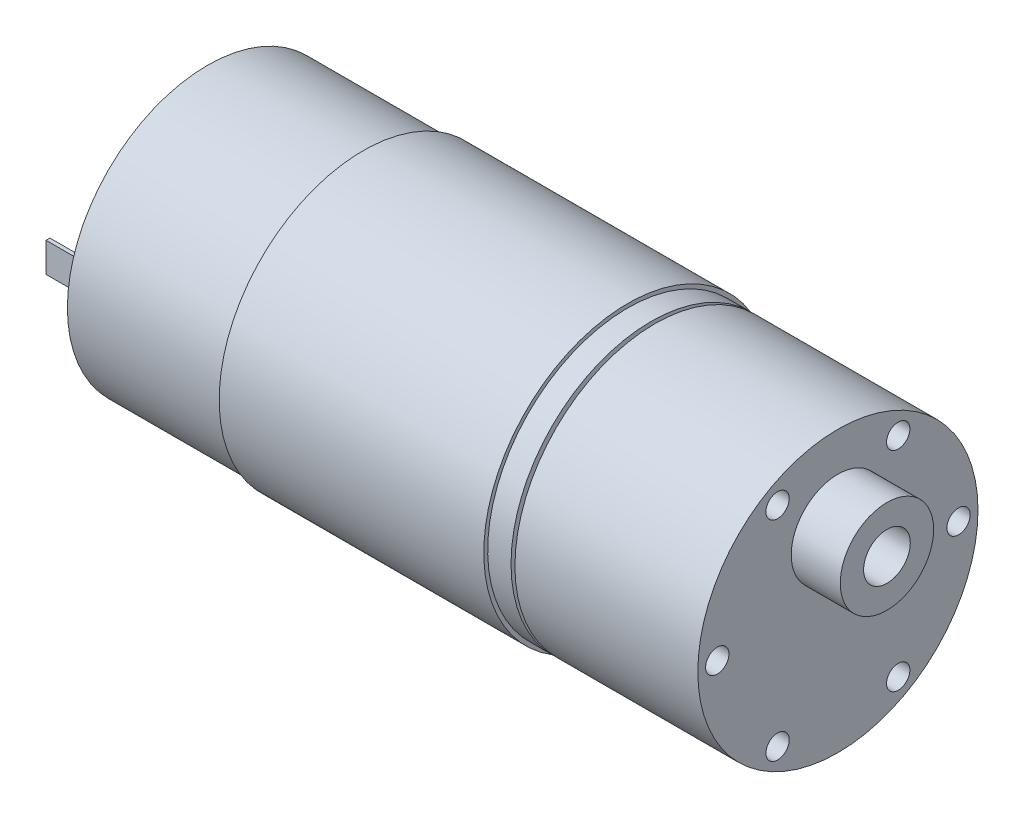
ISO-10303-21;
HEADER;
FILE_DESCRIPTION(('STEP AP214'),'2;1');
FILE_NAME('part.step','',(''),(''),'','','');
FILE_SCHEMA(('AUTOMOTIVE_DESIGN { 1 0 10303 214 1 1 1 1 }'));
ENDSEC;
DATA;
#1=APPLICATION_CONTEXT('core data for automotive mechanical design processes');
#2=APPLICATION_PROTOCOL_DEFINITION('international standard','automotive_design',2000,#1);
#3=PRODUCT_CONTEXT('',#1,'mechanical');
#4=PRODUCT('Part','Part','',(#3));
#5=PRODUCT_RELATED_PRODUCT_CATEGORY('part','',(#4));
#6=PRODUCT_DEFINITION_FORMATION('','',#4);
#7=PRODUCT_DEFINITION_CONTEXT('part definition',#1,'design');
#8=PRODUCT_DEFINITION('design','',#6,#7);
#9=PRODUCT_DEFINITION_SHAPE('','',#8);
#10=(LENGTH_UNIT() NAMED_UNIT(*) SI_UNIT(.MILLI.,.METRE.));
#11=(NAMED_UNIT(*) PLANE_ANGLE_UNIT() SI_UNIT($,.RADIAN.));
#12=(NAMED_UNIT(*) SI_UNIT($,.STERADIAN.) SOLID_ANGLE_UNIT());
#13=UNCERTAINTY_MEASURE_WITH_UNIT(LENGTH_MEASURE(1.E-05),#10,'distance_accuracy_value','');
#14=(GEOMETRIC_REPRESENTATION_CONTEXT(3) GLOBAL_UNCERTAINTY_ASSIGNED_CONTEXT((#13)) GLOBAL_UNIT_ASSIGNED_CONTEXT((#10,
#11,#12)) REPRESENTATION_CONTEXT('',''));
#15=CARTESIAN_POINT('',(0.,0.,0.));
#16=DIRECTION('',(0.,0.,1.));
#17=DIRECTION('',(1.,0.,0.));
#18=AXIS2_PLACEMENT_3D('',#15,#16,#17);
#19=CARTESIAN_POINT('',(57.,0.,0.));
#20=DIRECTION('',(-1.,0.,0.));
#21=DIRECTION('',(0.,0.,1.));
#22=AXIS2_PLACEMENT_3D('',#19,#20,#21);
#23=CYLINDRICAL_SURFACE('',#22,18.);
#24=CARTESIAN_POINT('',(0.,0.,0.));
#25=DIRECTION('',(1.,0.,0.));
#26=DIRECTION('',(0.,0.,-1.));
#27=AXIS2_PLACEMENT_3D('',#24,#25,#26);
#28=CIRCLE('',#27,18.);
#29=CARTESIAN_POINT('',(0.,0.,-18.));
#30=VERTEX_POINT('',#29);
#31=EDGE_CURVE('E286',#30,#30,#28,.T.);
#32=ORIENTED_EDGE('',*,*,#31,.T.);
#33=EDGE_LOOP('',(#32));
#34=FACE_BOUND('',#33,.T.);
#35=CARTESIAN_POINT('',(57.,0.,0.));
#36=DIRECTION('',(1.,0.,0.));
#37=DIRECTION('',(0.,0.,-1.));
#38=AXIS2_PLACEMENT_3D('',#35,#36,#37);
#39=CIRCLE('',#38,18.);
#40=CARTESIAN_POINT('',(57.,0.,-18.));
#41=VERTEX_POINT('',#40);
#42=EDGE_CURVE('E289',#41,#41,#39,.T.);
#43=ORIENTED_EDGE('',*,*,#42,.F.);
#44=EDGE_LOOP('',(#43));
#45=FACE_BOUND('',#44,.T.);
#46=CARTESIAN_POINT('',(20.,0.,0.));
#47=DIRECTION('',(-1.,0.,0.));
#48=DIRECTION('',(0.,0.,-1.));
#49=AXIS2_PLACEMENT_3D('',#46,#47,#48);
#50=CIRCLE('',#49,18.);
#51=CARTESIAN_POINT('',(20.,-17.7678985994565,2.88128085396592));
#52=VERTEX_POINT('',#51);
#53=CARTESIAN_POINT('',(20.,-17.7678985994565,-2.88128085396592));
#54=VERTEX_POINT('',#53);
#55=EDGE_CURVE('E138',#52,#54,#50,.T.);
#56=ORIENTED_EDGE('',*,*,#55,.T.);
#57=DIRECTION('',(1.,0.,0.));
#58=VECTOR('',#57,1.);
#59=CARTESIAN_POINT('',(20.,-17.7678985994565,-2.88128085396592));
#60=LINE('',#59,#58);
#61=CARTESIAN_POINT('',(54.,-17.7678985994565,-2.88128085396592));
#62=VERTEX_POINT('',#61);
#63=EDGE_CURVE('E156',#54,#62,#60,.T.);
#64=ORIENTED_EDGE('',*,*,#63,.T.);
#65=CARTESIAN_POINT('',(54.,0.,0.));
#66=DIRECTION('',(-1.,0.,0.));
#67=DIRECTION('',(0.,0.,-1.));
#68=AXIS2_PLACEMENT_3D('',#65,#66,#67);
#69=CIRCLE('',#68,18.);
#70=CARTESIAN_POINT('',(54.,-17.7678985994565,2.88128085396592));
#71=VERTEX_POINT('',#70);
#72=EDGE_CURVE('E145',#71,#62,#69,.T.);
#73=ORIENTED_EDGE('',*,*,#72,.F.);
#74=DIRECTION('',(1.,0.,0.));
#75=VECTOR('',#74,1.);
#76=CARTESIAN_POINT('',(20.,-17.7678985994565,2.88128085396592));
#77=LINE('',#76,#75);
#78=EDGE_CURVE('E128',#52,#71,#77,.T.);
#79=ORIENTED_EDGE('',*,*,#78,.F.);
#80=EDGE_LOOP('',(#56,#64,#73,#79));
#81=FACE_BOUND('',#80,.T.);
#82=ADVANCED_FACE('F32',(#34,#45,#81),#23,.T.);
#83=CARTESIAN_POINT('',(0.,0.,0.));
#84=DIRECTION('',(1.,0.,0.));
#85=DIRECTION('',(0.,0.,-1.));
#86=AXIS2_PLACEMENT_3D('',#83,#84,#85);
#87=PLANE('',#86);
#88=DIRECTION('',(0.,0.,-1.));
#89=VECTOR('',#88,1.);
#90=CARTESIAN_POINT('',(0.,1.9,13.25));
#91=LINE('',#90,#89);
#92=CARTESIAN_POINT('',(0.,1.9,13.75));
#93=VERTEX_POINT('',#92);
#94=CARTESIAN_POINT('',(0.,1.9,13.25));
#95=VERTEX_POINT('',#94);
#96=EDGE_CURVE('E189',#93,#95,#91,.T.);
#97=ORIENTED_EDGE('',*,*,#96,.F.);
#98=DIRECTION('',(0.,1.,0.));
#99=VECTOR('',#98,1.);
#100=CARTESIAN_POINT('',(0.,1.9,13.75));
#101=LINE('',#100,#99);
#102=CARTESIAN_POINT('',(0.,-1.9,13.75));
#103=VERTEX_POINT('',#102);
#104=EDGE_CURVE('E194',#103,#93,#101,.T.);
#105=ORIENTED_EDGE('',*,*,#104,.F.);
#106=DIRECTION('',(0.,0.,1.));
#107=VECTOR('',#106,1.);
#108=CARTESIAN_POINT('',(0.,-1.9,13.75));
#109=LINE('',#108,#107);
#110=CARTESIAN_POINT('',(0.,-1.9,13.25));
#111=VERTEX_POINT('',#110);
#112=EDGE_CURVE('E206',#111,#103,#109,.T.);
#113=ORIENTED_EDGE('',*,*,#112,.F.);
#114=DIRECTION('',(0.,-1.,0.));
#115=VECTOR('',#114,1.);
#116=CARTESIAN_POINT('',(0.,1.9,13.25));
#117=LINE('',#116,#115);
#118=EDGE_CURVE('E203',#95,#111,#117,.T.);
#119=ORIENTED_EDGE('',*,*,#118,.F.);
#120=EDGE_LOOP('',(#97,#105,#113,#119));
#121=FACE_BOUND('',#120,.T.);
#122=CARTESIAN_POINT('',(0.,0.,0.));
#123=DIRECTION('',(1.,0.,0.));
#124=DIRECTION('',(0.,0.,-1.));
#125=AXIS2_PLACEMENT_3D('',#122,#123,#124);
#126=CIRCLE('',#125,5.5);
#127=CARTESIAN_POINT('',(0.,0.,-5.5));
#128=VERTEX_POINT('',#127);
#129=EDGE_CURVE('E11',#128,#128,#126,.F.);
#130=ORIENTED_EDGE('',*,*,#129,.F.);
#131=EDGE_LOOP('',(#130));
#132=FACE_BOUND('',#131,.T.);
#133=ORIENTED_EDGE('',*,*,#31,.F.);
#134=EDGE_LOOP('',(#133));
#135=FACE_BOUND('',#134,.T.);
#136=DIRECTION('',(0.,0.,-1.));
#137=VECTOR('',#136,1.);
#138=CARTESIAN_POINT('',(0.,1.9,-13.6844517391735));
#139=LINE('',#138,#137);
#140=CARTESIAN_POINT('',(0.,1.9,-13.1844517391735));
#141=VERTEX_POINT('',#140);
#142=CARTESIAN_POINT('',(0.,1.9,-13.6844517391735));
#143=VERTEX_POINT('',#142);
#144=EDGE_CURVE('E155',#141,#143,#139,.T.);
#145=ORIENTED_EDGE('',*,*,#144,.F.);
#146=DIRECTION('',(0.,1.,0.));
#147=VECTOR('',#146,1.);
#148=CARTESIAN_POINT('',(0.,1.9,-13.1844517391735));
#149=LINE('',#148,#147);
#150=CARTESIAN_POINT('',(0.,-1.9,-13.1844517391735));
#151=VERTEX_POINT('',#150);
#152=EDGE_CURVE('E164',#151,#141,#149,.T.);
#153=ORIENTED_EDGE('',*,*,#152,.F.);
#154=DIRECTION('',(0.,0.,1.));
#155=VECTOR('',#154,1.);
#156=CARTESIAN_POINT('',(0.,-1.9,-13.1844517391735));
#157=LINE('',#156,#155);
#158=CARTESIAN_POINT('',(0.,-1.9,-13.6844517391735));
#159=VERTEX_POINT('',#158);
#160=EDGE_CURVE('E174',#159,#151,#157,.T.);
#161=ORIENTED_EDGE('',*,*,#160,.F.);
#162=DIRECTION('',(0.,-1.,0.));
#163=VECTOR('',#162,1.);
#164=CARTESIAN_POINT('',(0.,-1.9,-13.6844517391735));
#165=LINE('',#164,#163);
#166=EDGE_CURVE('E54',#143,#159,#165,.T.);
#167=ORIENTED_EDGE('',*,*,#166,.F.);
#168=EDGE_LOOP('',(#145,#153,#161,#167));
#169=FACE_BOUND('',#168,.T.);
#170=ADVANCED_FACE('F320',(#121,#132,#135,#169),#87,.F.);
#171=CARTESIAN_POINT('',(57.,0.,0.));
#172=DIRECTION('',(1.,0.,0.));
#173=DIRECTION('',(0.,0.,-1.));
#174=AXIS2_PLACEMENT_3D('',#171,#172,#173);
#175=PLANE('',#174);
#176=CARTESIAN_POINT('',(57.,0.,0.));
#177=DIRECTION('',(1.,0.,0.));
#178=DIRECTION('',(0.,0.,-1.));
#179=AXIS2_PLACEMENT_3D('',#176,#177,#178);
#180=CIRCLE('',#179,17.);
#181=CARTESIAN_POINT('',(57.,0.,-17.));
#182=VERTEX_POINT('',#181);
#183=EDGE_CURVE('E280',#182,#182,#180,.T.);
#184=ORIENTED_EDGE('',*,*,#183,.F.);
#185=EDGE_LOOP('',(#184));
#186=FACE_BOUND('',#185,.T.);
#187=ORIENTED_EDGE('',*,*,#42,.T.);
#188=EDGE_LOOP('',(#187));
#189=FACE_BOUND('',#188,.T.);
#190=ADVANCED_FACE('F325',(#186,#189),#175,.T.);
#191=CARTESIAN_POINT('',(57.5,0.,0.));
#192=DIRECTION('',(-1.,0.,0.));
#193=DIRECTION('',(0.,0.,1.));
#194=AXIS2_PLACEMENT_3D('',#191,#192,#193);
#195=CYLINDRICAL_SURFACE('',#194,17.);
#196=CARTESIAN_POINT('',(57.5,0.,0.));
#197=DIRECTION('',(1.,0.,0.));
#198=DIRECTION('',(0.,0.,-1.));
#199=AXIS2_PLACEMENT_3D('',#196,#197,#198);
#200=CIRCLE('',#199,17.);
#201=CARTESIAN_POINT('',(57.5,0.,-17.));
#202=VERTEX_POINT('',#201);
#203=EDGE_CURVE('E283',#202,#202,#200,.T.);
#204=ORIENTED_EDGE('',*,*,#203,.F.);
#205=EDGE_LOOP('',(#204));
#206=FACE_BOUND('',#205,.T.);
#207=ORIENTED_EDGE('',*,*,#183,.T.);
#208=EDGE_LOOP('',(#207));
#209=FACE_BOUND('',#208,.T.);
#210=ADVANCED_FACE('F462',(#206,#209),#195,.T.);
#211=CARTESIAN_POINT('',(81.,0.,0.));
#212=DIRECTION('',(-1.,0.,0.));
#213=DIRECTION('',(0.,0.,1.));
#214=AXIS2_PLACEMENT_3D('',#211,#212,#213);
#215=CYLINDRICAL_SURFACE('',#214,18.);
#216=CARTESIAN_POINT('',(81.,0.,0.));
#217=DIRECTION('',(1.,0.,0.));
#218=DIRECTION('',(0.,0.,-1.));
#219=AXIS2_PLACEMENT_3D('',#216,#217,#218);
#220=CIRCLE('',#219,18.);
#221=CARTESIAN_POINT('',(81.,0.,-18.));
#222=VERTEX_POINT('',#221);
#223=EDGE_CURVE('E277',#222,#222,#220,.T.);
#224=ORIENTED_EDGE('',*,*,#223,.F.);
#225=EDGE_LOOP('',(#224));
#226=FACE_BOUND('',#225,.T.);
#227=CARTESIAN_POINT('',(57.5,0.,0.));
#228=DIRECTION('',(1.,0.,0.));
#229=DIRECTION('',(0.,0.,-1.));
#230=AXIS2_PLACEMENT_3D('',#227,#228,#229);
#231=CIRCLE('',#230,18.);
#232=CARTESIAN_POINT('',(57.5,0.,-18.));
#233=VERTEX_POINT('',#232);
#234=EDGE_CURVE('E274',#233,#233,#231,.T.);
#235=ORIENTED_EDGE('',*,*,#234,.T.);
#236=EDGE_LOOP('',(#235));
#237=FACE_BOUND('',#236,.T.);
#238=ADVANCED_FACE('F317',(#226,#237),#215,.T.);
#239=CARTESIAN_POINT('',(81.,0.,0.));
#240=DIRECTION('',(1.,0.,0.));
#241=DIRECTION('',(0.,0.,-1.));
#242=AXIS2_PLACEMENT_3D('',#239,#240,#241);
#243=PLANE('',#242);
#244=CARTESIAN_POINT('',(81.,13.4233937586588,7.74999999999997));
#245=DIRECTION('',(1.,0.,0.));
#246=DIRECTION('',(0.,0.,-1.));
#247=AXIS2_PLACEMENT_3D('',#244,#245,#246);
#248=CIRCLE('',#247,1.5);
#249=CARTESIAN_POINT('',(81.,13.4233937586588,6.24999999999997));
#250=VERTEX_POINT('',#249);
#251=EDGE_CURVE('E236',#250,#250,#248,.T.);
#252=ORIENTED_EDGE('',*,*,#251,.F.);
#253=EDGE_LOOP('',(#252));
#254=FACE_BOUND('',#253,.T.);
#255=CARTESIAN_POINT('',(81.,13.4233937586588,-7.75000000000006));
#256=DIRECTION('',(1.,0.,0.));
#257=DIRECTION('',(0.,0.,-1.));
#258=AXIS2_PLACEMENT_3D('',#255,#256,#257);
#259=CIRCLE('',#258,1.5);
#260=CARTESIAN_POINT('',(81.,13.4233937586588,-9.25000000000006));
#261=VERTEX_POINT('',#260);
#262=EDGE_CURVE('E242',#261,#261,#259,.T.);
#263=ORIENTED_EDGE('',*,*,#262,.F.);
#264=EDGE_LOOP('',(#263));
#265=FACE_BOUND('',#264,.T.);
#266=CARTESIAN_POINT('',(81.,-1.06337718965459E-13,-15.5));
#267=DIRECTION('',(1.,0.,0.));
#268=DIRECTION('',(0.,0.,-1.));
#269=AXIS2_PLACEMENT_3D('',#266,#267,#268);
#270=CIRCLE('',#269,1.5);
#271=CARTESIAN_POINT('',(81.,-1.06337718965459E-13,-17.));
#272=VERTEX_POINT('',#271);
#273=EDGE_CURVE('E248',#272,#272,#270,.T.);
#274=ORIENTED_EDGE('',*,*,#273,.F.);
#275=EDGE_LOOP('',(#274));
#276=FACE_BOUND('',#275,.T.);
#277=CARTESIAN_POINT('',(81.,-13.4233937586589,-7.74999999999988));
#278=DIRECTION('',(1.,0.,0.));
#279=DIRECTION('',(0.,0.,-1.));
#280=AXIS2_PLACEMENT_3D('',#277,#278,#279);
#281=CIRCLE('',#280,1.5);
#282=CARTESIAN_POINT('',(81.,-13.4233937586589,-9.24999999999988));
#283=VERTEX_POINT('',#282);
#284=EDGE_CURVE('E254',#283,#283,#281,.T.);
#285=ORIENTED_EDGE('',*,*,#284,.F.);
#286=EDGE_LOOP('',(#285));
#287=FACE_BOUND('',#286,.T.);
#288=CARTESIAN_POINT('',(81.,-13.4233937586587,7.75000000000016));
#289=DIRECTION('',(1.,0.,0.));
#290=DIRECTION('',(0.,0.,-1.));
#291=AXIS2_PLACEMENT_3D('',#288,#289,#290);
#292=CIRCLE('',#291,1.5);
#293=CARTESIAN_POINT('',(81.,-13.4233937586587,6.25000000000015));
#294=VERTEX_POINT('',#293);
#295=EDGE_CURVE('E231',#294,#294,#292,.T.);
#296=ORIENTED_EDGE('',*,*,#295,.F.);
#297=EDGE_LOOP('',(#296));
#298=FACE_BOUND('',#297,.T.);
#299=CARTESIAN_POINT('',(81.,0.,15.5));
#300=DIRECTION('',(1.,0.,0.));
#301=DIRECTION('',(0.,0.,-1.));
#302=AXIS2_PLACEMENT_3D('',#299,#300,#301);
#303=CIRCLE('',#302,1.5);
#304=CARTESIAN_POINT('',(81.,0.,14.));
#305=VERTEX_POINT('',#304);
#306=EDGE_CURVE('E235',#305,#305,#303,.T.);
#307=ORIENTED_EDGE('',*,*,#306,.F.);
#308=EDGE_LOOP('',(#307));
#309=FACE_BOUND('',#308,.T.);
#310=CARTESIAN_POINT('',(81.,7.,0.));
#311=DIRECTION('',(1.,0.,0.));
#312=DIRECTION('',(0.,0.,-1.));
#313=AXIS2_PLACEMENT_3D('',#310,#311,#312);
#314=CIRCLE('',#313,6.);
#315=CARTESIAN_POINT('',(81.,7.,-6.));
#316=VERTEX_POINT('',#315);
#317=EDGE_CURVE('E270',#316,#316,#314,.T.);
#318=ORIENTED_EDGE('',*,*,#317,.F.);
#319=EDGE_LOOP('',(#318));
#320=FACE_BOUND('',#319,.T.);
#321=ORIENTED_EDGE('',*,*,#223,.T.);
#322=EDGE_LOOP('',(#321));
#323=FACE_BOUND('',#322,.T.);
#324=ADVANCED_FACE('F302',(#254,#265,#276,#287,#298,#309,#320,#323),#243,.T.);
#325=CARTESIAN_POINT('',(57.5,0.,0.));
#326=DIRECTION('',(1.,0.,0.));
#327=DIRECTION('',(0.,0.,-1.));
#328=AXIS2_PLACEMENT_3D('',#325,#326,#327);
#329=PLANE('',#328);
#330=ORIENTED_EDGE('',*,*,#203,.T.);
#331=EDGE_LOOP('',(#330));
#332=FACE_BOUND('',#331,.T.);
#333=ORIENTED_EDGE('',*,*,#234,.F.);
#334=EDGE_LOOP('',(#333));
#335=FACE_BOUND('',#334,.T.);
#336=ADVANCED_FACE('F316',(#332,#335),#329,.F.);
#337=CARTESIAN_POINT('',(87.3,7.,0.));
#338=DIRECTION('',(1.,0.,0.));
#339=DIRECTION('',(0.,0.,-1.));
#340=AXIS2_PLACEMENT_3D('',#337,#338,#339);
#341=PLANE('',#340);
#342=CARTESIAN_POINT('',(87.3,7.,0.));
#343=DIRECTION('',(1.,0.,0.));
#344=DIRECTION('',(0.,0.,-1.));
#345=AXIS2_PLACEMENT_3D('',#342,#343,#344);
#346=CIRCLE('',#345,6.);
#347=CARTESIAN_POINT('',(87.3,7.,-6.));
#348=VERTEX_POINT('',#347);
#349=EDGE_CURVE('E271',#348,#348,#346,.T.);
#350=ORIENTED_EDGE('',*,*,#349,.T.);
#351=EDGE_LOOP('',(#350));
#352=FACE_BOUND('',#351,.T.);
#353=CARTESIAN_POINT('',(87.3,7.,0.));
#354=DIRECTION('',(1.,0.,0.));
#355=DIRECTION('',(0.,0.,-1.));
#356=AXIS2_PLACEMENT_3D('',#353,#354,#355);
#357=CIRCLE('',#356,3.);
#358=CARTESIAN_POINT('',(87.3,7.,-3.));
#359=VERTEX_POINT('',#358);
#360=EDGE_CURVE('E265',#359,#359,#357,.T.);
#361=ORIENTED_EDGE('',*,*,#360,.F.);
#362=EDGE_LOOP('',(#361));
#363=FACE_BOUND('',#362,.T.);
#364=ADVANCED_FACE('F446',(#352,#363),#341,.T.);
#365=CARTESIAN_POINT('',(87.3,7.,0.));
#366=DIRECTION('',(-1.,0.,0.));
#367=DIRECTION('',(0.,0.,1.));
#368=AXIS2_PLACEMENT_3D('',#365,#366,#367);
#369=CYLINDRICAL_SURFACE('',#368,6.);
#370=ORIENTED_EDGE('',*,*,#349,.F.);
#371=EDGE_LOOP('',(#370));
#372=FACE_BOUND('',#371,.T.);
#373=ORIENTED_EDGE('',*,*,#317,.T.);
#374=EDGE_LOOP('',(#373));
#375=FACE_BOUND('',#374,.T.);
#376=ADVANCED_FACE('F310',(#372,#375),#369,.T.);
#377=CARTESIAN_POINT('',(87.3,7.,0.));
#378=DIRECTION('',(-1.,0.,0.));
#379=DIRECTION('',(0.,0.,1.));
#380=AXIS2_PLACEMENT_3D('',#377,#378,#379);
#381=CYLINDRICAL_SURFACE('',#380,3.);
#382=ORIENTED_EDGE('',*,*,#360,.T.);
#383=EDGE_LOOP('',(#382));
#384=FACE_BOUND('',#383,.T.);
#385=CARTESIAN_POINT('',(81.,7.,0.));
#386=DIRECTION('',(1.,0.,0.));
#387=DIRECTION('',(0.,0.,-1.));
#388=AXIS2_PLACEMENT_3D('',#385,#386,#387);
#389=CIRCLE('',#388,3.);
#390=CARTESIAN_POINT('',(81.,7.,-3.));
#391=VERTEX_POINT('',#390);
#392=EDGE_CURVE('E39',#391,#391,#389,.F.);
#393=ORIENTED_EDGE('',*,*,#392,.T.);
#394=EDGE_LOOP('',(#393));
#395=FACE_BOUND('',#394,.T.);
#396=ADVANCED_FACE('F296',(#384,#395),#381,.F.);
#397=ORIENTED_EDGE('',*,*,#392,.F.);
#398=EDGE_LOOP('',(#397));
#399=FACE_BOUND('',#398,.T.);
#400=ADVANCED_FACE('F298',(#399),#243,.T.);
#401=CARTESIAN_POINT('',(77.5,0.,15.5));
#402=DIRECTION('',(1.,0.,0.));
#403=DIRECTION('',(0.,0.,-1.));
#404=AXIS2_PLACEMENT_3D('',#401,#402,#403);
#405=CYLINDRICAL_SURFACE('',#404,1.5);
#406=CARTESIAN_POINT('',(77.5,0.,15.5));
#407=DIRECTION('',(1.,0.,0.));
#408=DIRECTION('',(0.,0.,-1.));
#409=AXIS2_PLACEMENT_3D('',#406,#407,#408);
#410=CIRCLE('',#409,1.5);
#411=CARTESIAN_POINT('',(77.5,0.,14.));
#412=VERTEX_POINT('',#411);
#413=EDGE_CURVE('E262',#412,#412,#410,.T.);
#414=ORIENTED_EDGE('',*,*,#413,.F.);
#415=EDGE_LOOP('',(#414));
#416=FACE_BOUND('',#415,.T.);
#417=ORIENTED_EDGE('',*,*,#306,.T.);
#418=EDGE_LOOP('',(#417));
#419=FACE_BOUND('',#418,.T.);
#420=ADVANCED_FACE('F300',(#416,#419),#405,.F.);
#421=CARTESIAN_POINT('',(77.5,0.,15.5));
#422=DIRECTION('',(1.,0.,0.));
#423=DIRECTION('',(0.,0.,-1.));
#424=AXIS2_PLACEMENT_3D('',#421,#422,#423);
#425=PLANE('',#424);
#426=ORIENTED_EDGE('',*,*,#413,.T.);
#427=EDGE_LOOP('',(#426));
#428=FACE_BOUND('',#427,.T.);
#429=ADVANCED_FACE('F307',(#428),#425,.T.);
#430=CARTESIAN_POINT('',(77.5,-13.4233937586587,7.75000000000016));
#431=DIRECTION('',(1.,0.,0.));
#432=DIRECTION('',(0.,0.,-1.));
#433=AXIS2_PLACEMENT_3D('',#430,#431,#432);
#434=CYLINDRICAL_SURFACE('',#433,1.5);
#435=CARTESIAN_POINT('',(77.5,-13.4233937586587,7.75000000000016));
#436=DIRECTION('',(1.,0.,0.));
#437=DIRECTION('',(0.,0.,-1.));
#438=AXIS2_PLACEMENT_3D('',#435,#436,#437);
#439=CIRCLE('',#438,1.5);
#440=CARTESIAN_POINT('',(77.5,-13.4233937586587,6.25000000000015));
#441=VERTEX_POINT('',#440);
#442=EDGE_CURVE('E257',#441,#441,#439,.T.);
#443=ORIENTED_EDGE('',*,*,#442,.F.);
#444=EDGE_LOOP('',(#443));
#445=FACE_BOUND('',#444,.T.);
#446=ORIENTED_EDGE('',*,*,#295,.T.);
#447=EDGE_LOOP('',(#446));
#448=FACE_BOUND('',#447,.T.);
#449=ADVANCED_FACE('F438',(#445,#448),#434,.F.);
#450=CARTESIAN_POINT('',(77.5,-13.4233937586587,7.75000000000016));
#451=DIRECTION('',(1.,0.,0.));
#452=DIRECTION('',(0.,0.,-1.));
#453=AXIS2_PLACEMENT_3D('',#450,#451,#452);
#454=PLANE('',#453);
#455=ORIENTED_EDGE('',*,*,#442,.T.);
#456=EDGE_LOOP('',(#455));
#457=FACE_BOUND('',#456,.T.);
#458=ADVANCED_FACE('F434',(#457),#454,.T.);
#459=CARTESIAN_POINT('',(77.5,-13.4233937586589,-7.74999999999988));
#460=DIRECTION('',(1.,0.,0.));
#461=DIRECTION('',(0.,0.,-1.));
#462=AXIS2_PLACEMENT_3D('',#459,#460,#461);
#463=CYLINDRICAL_SURFACE('',#462,1.5);
#464=CARTESIAN_POINT('',(77.5,-13.4233937586589,-7.74999999999988));
#465=DIRECTION('',(1.,0.,0.));
#466=DIRECTION('',(0.,0.,-1.));
#467=AXIS2_PLACEMENT_3D('',#464,#465,#466);
#468=CIRCLE('',#467,1.5);
#469=CARTESIAN_POINT('',(77.5,-13.4233937586589,-9.24999999999988));
#470=VERTEX_POINT('',#469);
#471=EDGE_CURVE('E251',#470,#470,#468,.T.);
#472=ORIENTED_EDGE('',*,*,#471,.F.);
#473=EDGE_LOOP('',(#472));
#474=FACE_BOUND('',#473,.T.);
#475=ORIENTED_EDGE('',*,*,#284,.T.);
#476=EDGE_LOOP('',(#475));
#477=FACE_BOUND('',#476,.T.);
#478=ADVANCED_FACE('F430',(#474,#477),#463,.F.);
#479=CARTESIAN_POINT('',(77.5,-13.4233937586589,-7.74999999999988));
#480=DIRECTION('',(1.,0.,0.));
#481=DIRECTION('',(0.,0.,-1.));
#482=AXIS2_PLACEMENT_3D('',#479,#480,#481);
#483=PLANE('',#482);
#484=ORIENTED_EDGE('',*,*,#471,.T.);
#485=EDGE_LOOP('',(#484));
#486=FACE_BOUND('',#485,.T.);
#487=ADVANCED_FACE('F426',(#486),#483,.T.);
#488=CARTESIAN_POINT('',(77.5,-1.06337718965459E-13,-15.5));
#489=DIRECTION('',(1.,0.,0.));
#490=DIRECTION('',(0.,0.,-1.));
#491=AXIS2_PLACEMENT_3D('',#488,#489,#490);
#492=CYLINDRICAL_SURFACE('',#491,1.5);
#493=CARTESIAN_POINT('',(77.5,-1.06337718965459E-13,-15.5));
#494=DIRECTION('',(1.,0.,0.));
#495=DIRECTION('',(0.,0.,-1.));
#496=AXIS2_PLACEMENT_3D('',#493,#494,#495);
#497=CIRCLE('',#496,1.5);
#498=CARTESIAN_POINT('',(77.5,-1.06337718965459E-13,-17.));
#499=VERTEX_POINT('',#498);
#500=EDGE_CURVE('E245',#499,#499,#497,.T.);
#501=ORIENTED_EDGE('',*,*,#500,.F.);
#502=EDGE_LOOP('',(#501));
#503=FACE_BOUND('',#502,.T.);
#504=ORIENTED_EDGE('',*,*,#273,.T.);
#505=EDGE_LOOP('',(#504));
#506=FACE_BOUND('',#505,.T.);
#507=ADVANCED_FACE('F422',(#503,#506),#492,.F.);
#508=CARTESIAN_POINT('',(77.5,-1.06337718965459E-13,-15.5));
#509=DIRECTION('',(1.,0.,0.));
#510=DIRECTION('',(0.,0.,-1.));
#511=AXIS2_PLACEMENT_3D('',#508,#509,#510);
#512=PLANE('',#511);
#513=ORIENTED_EDGE('',*,*,#500,.T.);
#514=EDGE_LOOP('',(#513));
#515=FACE_BOUND('',#514,.T.);
#516=ADVANCED_FACE('F418',(#515),#512,.T.);
#517=CARTESIAN_POINT('',(77.5,13.4233937586588,-7.75000000000006));
#518=DIRECTION('',(1.,0.,0.));
#519=DIRECTION('',(0.,0.,-1.));
#520=AXIS2_PLACEMENT_3D('',#517,#518,#519);
#521=CYLINDRICAL_SURFACE('',#520,1.5);
#522=CARTESIAN_POINT('',(77.5,13.4233937586588,-7.75000000000006));
#523=DIRECTION('',(1.,0.,0.));
#524=DIRECTION('',(0.,0.,-1.));
#525=AXIS2_PLACEMENT_3D('',#522,#523,#524);
#526=CIRCLE('',#525,1.5);
#527=CARTESIAN_POINT('',(77.5,13.4233937586588,-9.25000000000006));
#528=VERTEX_POINT('',#527);
#529=EDGE_CURVE('E239',#528,#528,#526,.T.);
#530=ORIENTED_EDGE('',*,*,#529,.F.);
#531=EDGE_LOOP('',(#530));
#532=FACE_BOUND('',#531,.T.);
#533=ORIENTED_EDGE('',*,*,#262,.T.);
#534=EDGE_LOOP('',(#533));
#535=FACE_BOUND('',#534,.T.);
#536=ADVANCED_FACE('F414',(#532,#535),#521,.F.);
#537=CARTESIAN_POINT('',(77.5,13.4233937586588,-7.75000000000006));
#538=DIRECTION('',(1.,0.,0.));
#539=DIRECTION('',(0.,0.,-1.));
#540=AXIS2_PLACEMENT_3D('',#537,#538,#539);
#541=PLANE('',#540);
#542=ORIENTED_EDGE('',*,*,#529,.T.);
#543=EDGE_LOOP('',(#542));
#544=FACE_BOUND('',#543,.T.);
#545=ADVANCED_FACE('F410',(#544),#541,.T.);
#546=CARTESIAN_POINT('',(77.5,13.4233937586588,7.74999999999997));
#547=DIRECTION('',(1.,0.,0.));
#548=DIRECTION('',(0.,0.,-1.));
#549=AXIS2_PLACEMENT_3D('',#546,#547,#548);
#550=CYLINDRICAL_SURFACE('',#549,1.5);
#551=CARTESIAN_POINT('',(77.5,13.4233937586588,7.74999999999997));
#552=DIRECTION('',(1.,0.,0.));
#553=DIRECTION('',(0.,0.,-1.));
#554=AXIS2_PLACEMENT_3D('',#551,#552,#553);
#555=CIRCLE('',#554,1.5);
#556=CARTESIAN_POINT('',(77.5,13.4233937586588,6.24999999999997));
#557=VERTEX_POINT('',#556);
#558=EDGE_CURVE('E232',#557,#557,#555,.T.);
#559=ORIENTED_EDGE('',*,*,#558,.F.);
#560=EDGE_LOOP('',(#559));
#561=FACE_BOUND('',#560,.T.);
#562=ORIENTED_EDGE('',*,*,#251,.T.);
#563=EDGE_LOOP('',(#562));
#564=FACE_BOUND('',#563,.T.);
#565=ADVANCED_FACE('F406',(#561,#564),#550,.F.);
#566=CARTESIAN_POINT('',(77.5,13.4233937586588,7.74999999999997));
#567=DIRECTION('',(1.,0.,0.));
#568=DIRECTION('',(0.,0.,-1.));
#569=AXIS2_PLACEMENT_3D('',#566,#567,#568);
#570=PLANE('',#569);
#571=ORIENTED_EDGE('',*,*,#558,.T.);
#572=EDGE_LOOP('',(#571));
#573=FACE_BOUND('',#572,.T.);
#574=ADVANCED_FACE('F402',(#573),#570,.T.);
#575=CARTESIAN_POINT('',(-2.,0.,0.));
#576=DIRECTION('',(1.,0.,0.));
#577=DIRECTION('',(0.,0.,-1.));
#578=AXIS2_PLACEMENT_3D('',#575,#576,#577);
#579=CYLINDRICAL_SURFACE('',#578,5.5);
#580=CARTESIAN_POINT('',(-2.,0.,0.));
#581=DIRECTION('',(-1.,0.,0.));
#582=DIRECTION('',(0.,0.,1.));
#583=AXIS2_PLACEMENT_3D('',#580,#581,#582);
#584=CIRCLE('',#583,5.5);
#585=CARTESIAN_POINT('',(-2.,0.,5.5));
#586=VERTEX_POINT('',#585);
#587=EDGE_CURVE('E226',#586,#586,#584,.T.);
#588=ORIENTED_EDGE('',*,*,#587,.F.);
#589=EDGE_LOOP('',(#588));
#590=FACE_BOUND('',#589,.T.);
#591=ORIENTED_EDGE('',*,*,#129,.T.);
#592=EDGE_LOOP('',(#591));
#593=FACE_BOUND('',#592,.T.);
#594=ADVANCED_FACE('F398',(#590,#593),#579,.T.);
#595=CARTESIAN_POINT('',(-2.,0.,0.));
#596=DIRECTION('',(-1.,0.,0.));
#597=DIRECTION('',(0.,0.,1.));
#598=AXIS2_PLACEMENT_3D('',#595,#596,#597);
#599=PLANE('',#598);
#600=CARTESIAN_POINT('',(-2.,0.,0.));
#601=DIRECTION('',(-1.,0.,0.));
#602=DIRECTION('',(0.,0.,1.));
#603=AXIS2_PLACEMENT_3D('',#600,#601,#602);
#604=CIRCLE('',#603,1.5);
#605=CARTESIAN_POINT('',(-2.,0.,1.5));
#606=VERTEX_POINT('',#605);
#607=EDGE_CURVE('E222',#606,#606,#604,.T.);
#608=ORIENTED_EDGE('',*,*,#607,.F.);
#609=EDGE_LOOP('',(#608));
#610=FACE_BOUND('',#609,.T.);
#611=ORIENTED_EDGE('',*,*,#587,.T.);
#612=EDGE_LOOP('',(#611));
#613=FACE_BOUND('',#612,.T.);
#614=ADVANCED_FACE('F394',(#610,#613),#599,.T.);
#615=CARTESIAN_POINT('',(-11.,0.,0.));
#616=DIRECTION('',(1.,0.,0.));
#617=DIRECTION('',(0.,0.,-1.));
#618=AXIS2_PLACEMENT_3D('',#615,#616,#617);
#619=CYLINDRICAL_SURFACE('',#618,1.5);
#620=CARTESIAN_POINT('',(-11.,0.,0.));
#621=DIRECTION('',(-1.,0.,0.));
#622=DIRECTION('',(0.,0.,1.));
#623=AXIS2_PLACEMENT_3D('',#620,#621,#622);
#624=CIRCLE('',#623,1.5);
#625=CARTESIAN_POINT('',(-11.,0.,1.5));
#626=VERTEX_POINT('',#625);
#627=EDGE_CURVE('E223',#626,#626,#624,.T.);
#628=ORIENTED_EDGE('',*,*,#627,.F.);
#629=EDGE_LOOP('',(#628));
#630=FACE_BOUND('',#629,.T.);
#631=ORIENTED_EDGE('',*,*,#607,.T.);
#632=EDGE_LOOP('',(#631));
#633=FACE_BOUND('',#632,.T.);
#634=ADVANCED_FACE('F390',(#630,#633),#619,.T.);
#635=CARTESIAN_POINT('',(-11.,0.,0.));
#636=DIRECTION('',(-1.,0.,0.));
#637=DIRECTION('',(0.,0.,1.));
#638=AXIS2_PLACEMENT_3D('',#635,#636,#637);
#639=PLANE('',#638);
#640=ORIENTED_EDGE('',*,*,#627,.T.);
#641=EDGE_LOOP('',(#640));
#642=FACE_BOUND('',#641,.T.);
#643=ADVANCED_FACE('F386',(#642),#639,.T.);
#644=CARTESIAN_POINT('',(-7.,1.9,13.25));
#645=DIRECTION('',(0.,-1.,0.));
#646=DIRECTION('',(0.,0.,-1.));
#647=AXIS2_PLACEMENT_3D('',#644,#645,#646);
#648=PLANE('',#647);
#649=ORIENTED_EDGE('',*,*,#96,.T.);
#650=DIRECTION('',(1.,0.,0.));
#651=VECTOR('',#650,1.);
#652=CARTESIAN_POINT('',(-7.,1.9,13.25));
#653=LINE('',#652,#651);
#654=CARTESIAN_POINT('',(-7.,1.9,13.25));
#655=VERTEX_POINT('',#654);
#656=EDGE_CURVE('E219',#655,#95,#653,.T.);
#657=ORIENTED_EDGE('',*,*,#656,.F.);
#658=DIRECTION('',(0.,0.,-1.));
#659=VECTOR('',#658,1.);
#660=CARTESIAN_POINT('',(-7.,1.9,13.25));
#661=LINE('',#660,#659);
#662=CARTESIAN_POINT('',(-7.,1.9,13.75));
#663=VERTEX_POINT('',#662);
#664=EDGE_CURVE('E190',#663,#655,#661,.T.);
#665=ORIENTED_EDGE('',*,*,#664,.F.);
#666=DIRECTION('',(1.,0.,0.));
#667=VECTOR('',#666,1.);
#668=CARTESIAN_POINT('',(-7.,1.9,13.75));
#669=LINE('',#668,#667);
#670=EDGE_CURVE('E200',#663,#93,#669,.T.);
#671=ORIENTED_EDGE('',*,*,#670,.T.);
#672=EDGE_LOOP('',(#649,#657,#665,#671));
#673=FACE_BOUND('',#672,.T.);
#674=ADVANCED_FACE('F382',(#673),#648,.F.);
#675=CARTESIAN_POINT('',(-7.,1.9,13.25));
#676=DIRECTION('',(0.,0.,1.));
#677=DIRECTION('',(1.,0.,0.));
#678=AXIS2_PLACEMENT_3D('',#675,#676,#677);
#679=PLANE('',#678);
#680=ORIENTED_EDGE('',*,*,#118,.T.);
#681=DIRECTION('',(1.,0.,0.));
#682=VECTOR('',#681,1.);
#683=CARTESIAN_POINT('',(-7.,-1.9,13.25));
#684=LINE('',#683,#682);
#685=CARTESIAN_POINT('',(-7.,-1.9,13.25));
#686=VERTEX_POINT('',#685);
#687=EDGE_CURVE('E216',#686,#111,#684,.T.);
#688=ORIENTED_EDGE('',*,*,#687,.F.);
#689=DIRECTION('',(0.,-1.,0.));
#690=VECTOR('',#689,1.);
#691=CARTESIAN_POINT('',(-7.,1.9,13.25));
#692=LINE('',#691,#690);
#693=EDGE_CURVE('E193',#655,#686,#692,.T.);
#694=ORIENTED_EDGE('',*,*,#693,.F.);
#695=ORIENTED_EDGE('',*,*,#656,.T.);
#696=EDGE_LOOP('',(#680,#688,#694,#695));
#697=FACE_BOUND('',#696,.T.);
#698=ADVANCED_FACE('F378',(#697),#679,.F.);
#699=CARTESIAN_POINT('',(-7.,-1.9,13.75));
#700=DIRECTION('',(0.,1.,0.));
#701=DIRECTION('',(0.,0.,1.));
#702=AXIS2_PLACEMENT_3D('',#699,#700,#701);
#703=PLANE('',#702);
#704=ORIENTED_EDGE('',*,*,#112,.T.);
#705=DIRECTION('',(1.,0.,0.));
#706=VECTOR('',#705,1.);
#707=CARTESIAN_POINT('',(-7.,-1.9,13.75));
#708=LINE('',#707,#706);
#709=CARTESIAN_POINT('',(-7.,-1.9,13.75));
#710=VERTEX_POINT('',#709);
#711=EDGE_CURVE('E213',#710,#103,#708,.T.);
#712=ORIENTED_EDGE('',*,*,#711,.F.);
#713=DIRECTION('',(0.,0.,1.));
#714=VECTOR('',#713,1.);
#715=CARTESIAN_POINT('',(-7.,-1.9,13.75));
#716=LINE('',#715,#714);
#717=EDGE_CURVE('E196',#686,#710,#716,.T.);
#718=ORIENTED_EDGE('',*,*,#717,.F.);
#719=ORIENTED_EDGE('',*,*,#687,.T.);
#720=EDGE_LOOP('',(#704,#712,#718,#719));
#721=FACE_BOUND('',#720,.T.);
#722=ADVANCED_FACE('F374',(#721),#703,.F.);
#723=CARTESIAN_POINT('',(-7.,1.9,13.75));
#724=DIRECTION('',(0.,0.,-1.));
#725=DIRECTION('',(-1.,0.,0.));
#726=AXIS2_PLACEMENT_3D('',#723,#724,#725);
#727=PLANE('',#726);
#728=ORIENTED_EDGE('',*,*,#104,.T.);
#729=ORIENTED_EDGE('',*,*,#670,.F.);
#730=DIRECTION('',(0.,1.,0.));
#731=VECTOR('',#730,1.);
#732=CARTESIAN_POINT('',(-7.,1.9,13.75));
#733=LINE('',#732,#731);
#734=EDGE_CURVE('E198',#710,#663,#733,.T.);
#735=ORIENTED_EDGE('',*,*,#734,.F.);
#736=ORIENTED_EDGE('',*,*,#711,.T.);
#737=EDGE_LOOP('',(#728,#729,#735,#736));
#738=FACE_BOUND('',#737,.T.);
#739=ADVANCED_FACE('F370',(#738),#727,.F.);
#740=CARTESIAN_POINT('',(-7.,0.,0.));
#741=DIRECTION('',(1.,0.,0.));
#742=DIRECTION('',(0.,0.,-1.));
#743=AXIS2_PLACEMENT_3D('',#740,#741,#742);
#744=PLANE('',#743);
#745=ORIENTED_EDGE('',*,*,#664,.T.);
#746=ORIENTED_EDGE('',*,*,#693,.T.);
#747=ORIENTED_EDGE('',*,*,#717,.T.);
#748=ORIENTED_EDGE('',*,*,#734,.T.);
#749=EDGE_LOOP('',(#745,#746,#747,#748));
#750=FACE_BOUND('',#749,.T.);
#751=ADVANCED_FACE('F366',(#750),#744,.F.);
#752=CARTESIAN_POINT('',(-7.,1.9,-13.6844517391735));
#753=DIRECTION('',(0.,-1.,0.));
#754=DIRECTION('',(0.,0.,-1.));
#755=AXIS2_PLACEMENT_3D('',#752,#753,#754);
#756=PLANE('',#755);
#757=ORIENTED_EDGE('',*,*,#144,.T.);
#758=DIRECTION('',(1.,0.,0.));
#759=VECTOR('',#758,1.);
#760=CARTESIAN_POINT('',(-7.,1.9,-13.6844517391735));
#761=LINE('',#760,#759);
#762=CARTESIAN_POINT('',(-7.,1.9,-13.6844517391735));
#763=VERTEX_POINT('',#762);
#764=EDGE_CURVE('E187',#763,#143,#761,.T.);
#765=ORIENTED_EDGE('',*,*,#764,.F.);
#766=DIRECTION('',(0.,0.,-1.));
#767=VECTOR('',#766,1.);
#768=CARTESIAN_POINT('',(-7.,1.9,-13.6844517391735));
#769=LINE('',#768,#767);
#770=CARTESIAN_POINT('',(-7.,1.9,-13.1844517391735));
#771=VERTEX_POINT('',#770);
#772=EDGE_CURVE('E160',#771,#763,#769,.T.);
#773=ORIENTED_EDGE('',*,*,#772,.F.);
#774=DIRECTION('',(1.,0.,0.));
#775=VECTOR('',#774,1.);
#776=CARTESIAN_POINT('',(-7.,1.9,-13.1844517391735));
#777=LINE('',#776,#775);
#778=EDGE_CURVE('E170',#771,#141,#777,.T.);
#779=ORIENTED_EDGE('',*,*,#778,.T.);
#780=EDGE_LOOP('',(#757,#765,#773,#779));
#781=FACE_BOUND('',#780,.T.);
#782=ADVANCED_FACE('F362',(#781),#756,.F.);
#783=CARTESIAN_POINT('',(-7.,-1.9,-13.6844517391735));
#784=DIRECTION('',(0.,0.,1.));
#785=DIRECTION('',(1.,0.,0.));
#786=AXIS2_PLACEMENT_3D('',#783,#784,#785);
#787=PLANE('',#786);
#788=ORIENTED_EDGE('',*,*,#166,.T.);
#789=DIRECTION('',(1.,0.,0.));
#790=VECTOR('',#789,1.);
#791=CARTESIAN_POINT('',(-7.,-1.9,-13.6844517391735));
#792=LINE('',#791,#790);
#793=CARTESIAN_POINT('',(-7.,-1.9,-13.6844517391735));
#794=VERTEX_POINT('',#793);
#795=EDGE_CURVE('E184',#794,#159,#792,.T.);
#796=ORIENTED_EDGE('',*,*,#795,.F.);
#797=DIRECTION('',(0.,-1.,0.));
#798=VECTOR('',#797,1.);
#799=CARTESIAN_POINT('',(-7.,-1.9,-13.6844517391735));
#800=LINE('',#799,#798);
#801=EDGE_CURVE('E163',#763,#794,#800,.T.);
#802=ORIENTED_EDGE('',*,*,#801,.F.);
#803=ORIENTED_EDGE('',*,*,#764,.T.);
#804=EDGE_LOOP('',(#788,#796,#802,#803));
#805=FACE_BOUND('',#804,.T.);
#806=ADVANCED_FACE('F358',(#805),#787,.F.);
#807=CARTESIAN_POINT('',(-7.,-1.9,-13.1844517391735));
#808=DIRECTION('',(0.,1.,0.));
#809=DIRECTION('',(0.,0.,1.));
#810=AXIS2_PLACEMENT_3D('',#807,#808,#809);
#811=PLANE('',#810);
#812=ORIENTED_EDGE('',*,*,#160,.T.);
#813=DIRECTION('',(1.,0.,0.));
#814=VECTOR('',#813,1.);
#815=CARTESIAN_POINT('',(-7.,-1.9,-13.1844517391735));
#816=LINE('',#815,#814);
#817=CARTESIAN_POINT('',(-7.,-1.9,-13.1844517391735));
#818=VERTEX_POINT('',#817);
#819=EDGE_CURVE('E181',#818,#151,#816,.T.);
#820=ORIENTED_EDGE('',*,*,#819,.F.);
#821=DIRECTION('',(0.,0.,1.));
#822=VECTOR('',#821,1.);
#823=CARTESIAN_POINT('',(-7.,-1.9,-13.1844517391735));
#824=LINE('',#823,#822);
#825=EDGE_CURVE('E166',#794,#818,#824,.T.);
#826=ORIENTED_EDGE('',*,*,#825,.F.);
#827=ORIENTED_EDGE('',*,*,#795,.T.);
#828=EDGE_LOOP('',(#812,#820,#826,#827));
#829=FACE_BOUND('',#828,.T.);
#830=ADVANCED_FACE('F354',(#829),#811,.F.);
#831=CARTESIAN_POINT('',(-7.,1.9,-13.1844517391735));
#832=DIRECTION('',(0.,0.,-1.));
#833=DIRECTION('',(-1.,0.,0.));
#834=AXIS2_PLACEMENT_3D('',#831,#832,#833);
#835=PLANE('',#834);
#836=ORIENTED_EDGE('',*,*,#152,.T.);
#837=ORIENTED_EDGE('',*,*,#778,.F.);
#838=DIRECTION('',(0.,1.,0.));
#839=VECTOR('',#838,1.);
#840=CARTESIAN_POINT('',(-7.,1.9,-13.1844517391735));
#841=LINE('',#840,#839);
#842=EDGE_CURVE('E168',#818,#771,#841,.T.);
#843=ORIENTED_EDGE('',*,*,#842,.F.);
#844=ORIENTED_EDGE('',*,*,#819,.T.);
#845=EDGE_LOOP('',(#836,#837,#843,#844));
#846=FACE_BOUND('',#845,.T.);
#847=ADVANCED_FACE('F350',(#846),#835,.F.);
#848=CARTESIAN_POINT('',(-7.,0.,0.));
#849=DIRECTION('',(1.,0.,0.));
#850=DIRECTION('',(0.,0.,-1.));
#851=AXIS2_PLACEMENT_3D('',#848,#849,#850);
#852=PLANE('',#851);
#853=ORIENTED_EDGE('',*,*,#772,.T.);
#854=ORIENTED_EDGE('',*,*,#801,.T.);
#855=ORIENTED_EDGE('',*,*,#825,.T.);
#856=ORIENTED_EDGE('',*,*,#842,.T.);
#857=EDGE_LOOP('',(#853,#854,#855,#856));
#858=FACE_BOUND('',#857,.T.);
#859=ADVANCED_FACE('F343',(#858),#852,.F.);
#860=CARTESIAN_POINT('',(20.,0.,0.));
#861=DIRECTION('',(1.,0.,0.));
#862=DIRECTION('',(0.,0.,-1.));
#863=AXIS2_PLACEMENT_3D('',#860,#861,#862);
#864=CYLINDRICAL_SURFACE('',#863,18.5);
#865=CARTESIAN_POINT('',(54.,0.,0.));
#866=DIRECTION('',(1.,0.,0.));
#867=DIRECTION('',(0.,0.,-1.));
#868=AXIS2_PLACEMENT_3D('',#865,#866,#867);
#869=CIRCLE('',#868,18.5);
#870=CARTESIAN_POINT('',(54.,-18.2614513383303,-2.96131643324276));
#871=VERTEX_POINT('',#870);
#872=CARTESIAN_POINT('',(54.,-18.2614513383303,2.96131643324275));
#873=VERTEX_POINT('',#872);
#874=EDGE_CURVE('E150',#871,#873,#869,.T.);
#875=ORIENTED_EDGE('',*,*,#874,.F.);
#876=DIRECTION('',(1.,0.,0.));
#877=VECTOR('',#876,1.);
#878=CARTESIAN_POINT('',(20.,-18.2614513383303,-2.96131643324276));
#879=LINE('',#878,#877);
#880=CARTESIAN_POINT('',(20.,-18.2614513383303,-2.96131643324276));
#881=VERTEX_POINT('',#880);
#882=EDGE_CURVE('E141',#881,#871,#879,.T.);
#883=ORIENTED_EDGE('',*,*,#882,.F.);
#884=CARTESIAN_POINT('',(20.,0.,0.));
#885=DIRECTION('',(1.,0.,0.));
#886=DIRECTION('',(0.,0.,-1.));
#887=AXIS2_PLACEMENT_3D('',#884,#885,#886);
#888=CIRCLE('',#887,18.5);
#889=CARTESIAN_POINT('',(20.,-18.2614513383303,2.96131643324275));
#890=VERTEX_POINT('',#889);
#891=EDGE_CURVE('E135',#881,#890,#888,.T.);
#892=ORIENTED_EDGE('',*,*,#891,.T.);
#893=DIRECTION('',(1.,0.,0.));
#894=VECTOR('',#893,1.);
#895=CARTESIAN_POINT('',(20.,-18.2614513383303,2.96131643324275));
#896=LINE('',#895,#894);
#897=EDGE_CURVE('E120',#890,#873,#896,.T.);
#898=ORIENTED_EDGE('',*,*,#897,.T.);
#899=EDGE_LOOP('',(#875,#883,#892,#898));
#900=FACE_BOUND('',#899,.T.);
#901=ADVANCED_FACE('F140',(#900),#864,.T.);
#902=CARTESIAN_POINT('',(20.,-17.7678985994565,-2.88128085396593));
#903=DIRECTION('',(0.,-0.160071158553662,0.987105477747585));
#904=DIRECTION('',(0.,-0.987105477747585,-0.160071158553663));
#905=AXIS2_PLACEMENT_3D('',#902,#903,#904);
#906=PLANE('',#905);
#907=DIRECTION('',(0.,-0.987105477747585,-0.160071158553662));
#908=VECTOR('',#907,1.);
#909=CARTESIAN_POINT('',(54.,-17.7678985994565,-2.88128085396593));
#910=LINE('',#909,#908);
#911=EDGE_CURVE('E142',#62,#871,#910,.T.);
#912=ORIENTED_EDGE('',*,*,#911,.F.);
#913=ORIENTED_EDGE('',*,*,#63,.F.);
#914=DIRECTION('',(0.,-0.987105477747585,-0.160071158553662));
#915=VECTOR('',#914,1.);
#916=CARTESIAN_POINT('',(20.,-17.7678985994565,-2.88128085396593));
#917=LINE('',#916,#915);
#918=EDGE_CURVE('E129',#54,#881,#917,.T.);
#919=ORIENTED_EDGE('',*,*,#918,.T.);
#920=ORIENTED_EDGE('',*,*,#882,.T.);
#921=EDGE_LOOP('',(#912,#913,#919,#920));
#922=FACE_BOUND('',#921,.T.);
#923=ADVANCED_FACE('F335',(#922),#906,.T.);
#924=CARTESIAN_POINT('',(20.,-18.2614513383303,2.96131643324275));
#925=DIRECTION('',(0.,-0.160071158553662,-0.987105477747585));
#926=DIRECTION('',(0.,0.987105477747585,-0.160071158553663));
#927=AXIS2_PLACEMENT_3D('',#924,#925,#926);
#928=PLANE('',#927);
#929=DIRECTION('',(0.,0.987105477747585,-0.160071158553662));
#930=VECTOR('',#929,1.);
#931=CARTESIAN_POINT('',(54.,-18.2614513383303,2.96131643324275));
#932=LINE('',#931,#930);
#933=EDGE_CURVE('E46',#873,#71,#932,.T.);
#934=ORIENTED_EDGE('',*,*,#933,.F.);
#935=ORIENTED_EDGE('',*,*,#897,.F.);
#936=DIRECTION('',(0.,0.987105477747585,-0.160071158553662));
#937=VECTOR('',#936,1.);
#938=CARTESIAN_POINT('',(20.,-18.2614513383303,2.96131643324275));
#939=LINE('',#938,#937);
#940=EDGE_CURVE('E123',#890,#52,#939,.T.);
#941=ORIENTED_EDGE('',*,*,#940,.T.);
#942=ORIENTED_EDGE('',*,*,#78,.T.);
#943=EDGE_LOOP('',(#934,#935,#941,#942));
#944=FACE_BOUND('',#943,.T.);
#945=ADVANCED_FACE('F122',(#944),#928,.T.);
#946=CARTESIAN_POINT('',(20.,0.,0.));
#947=DIRECTION('',(1.,0.,0.));
#948=DIRECTION('',(0.,0.,-1.));
#949=AXIS2_PLACEMENT_3D('',#946,#947,#948);
#950=PLANE('',#949);
#951=ORIENTED_EDGE('',*,*,#891,.F.);
#952=ORIENTED_EDGE('',*,*,#918,.F.);
#953=ORIENTED_EDGE('',*,*,#55,.F.);
#954=ORIENTED_EDGE('',*,*,#940,.F.);
#955=EDGE_LOOP('',(#951,#952,#953,#954));
#956=FACE_BOUND('',#955,.T.);
#957=ADVANCED_FACE('F133',(#956),#950,.F.);
#958=CARTESIAN_POINT('',(54.,0.,0.));
#959=DIRECTION('',(1.,0.,0.));
#960=DIRECTION('',(0.,0.,-1.));
#961=AXIS2_PLACEMENT_3D('',#958,#959,#960);
#962=PLANE('',#961);
#963=ORIENTED_EDGE('',*,*,#874,.T.);
#964=ORIENTED_EDGE('',*,*,#933,.T.);
#965=ORIENTED_EDGE('',*,*,#72,.T.);
#966=ORIENTED_EDGE('',*,*,#911,.T.);
#967=EDGE_LOOP('',(#963,#964,#965,#966));
#968=FACE_BOUND('',#967,.T.);
#969=ADVANCED_FACE('F333',(#968),#962,.T.);
#970=CLOSED_SHELL('',(#82,#170,#190,#210,#238,#324,#336,#364,#376,#396,#400,#420,#429,#449,#458,
#478,#487,#507,#516,#536,#545,#565,#574,#594,#614,#634,#643,#674,#698,#722,#739,#751,#782,#806,
#830,#847,#859,#901,#923,#945,#957,#969));
#971=MANIFOLD_SOLID_BREP('B2',#970);
#972=ADVANCED_BREP_SHAPE_REPRESENTATION('',(#18,#971),#14);
#973=SHAPE_DEFINITION_REPRESENTATION(#9,#972);
ENDSEC;
END-ISO-10303-21;
